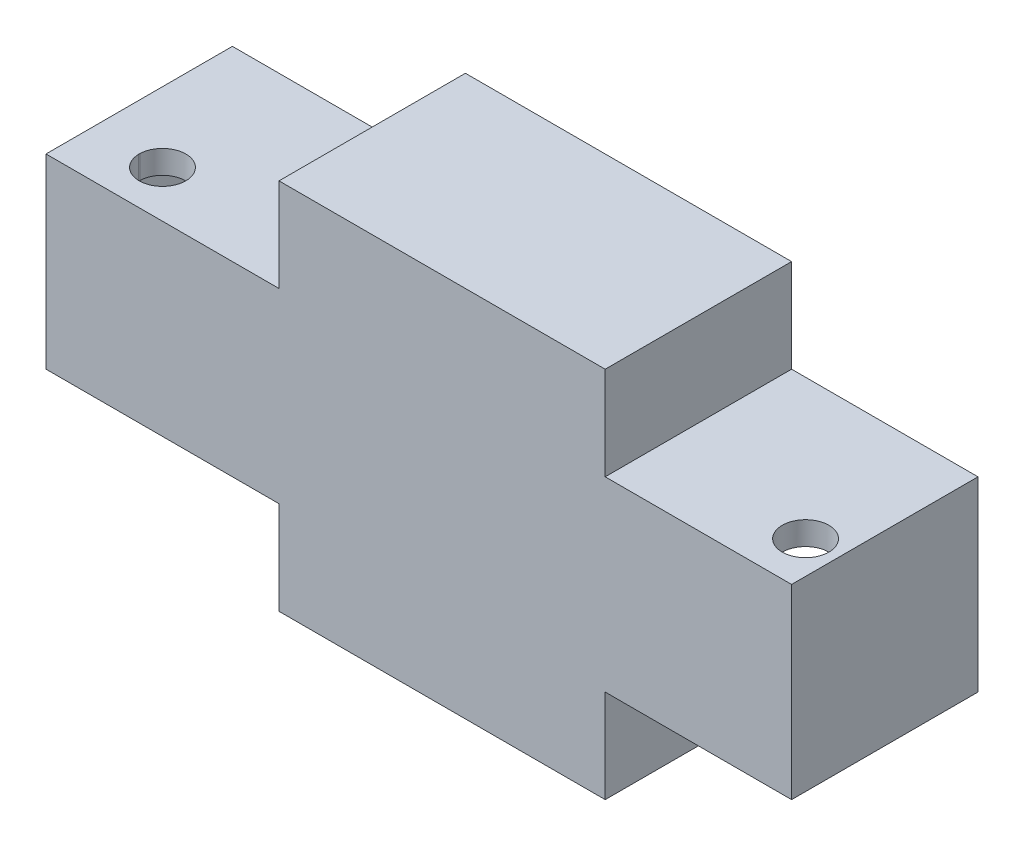
ISO-10303-21;
HEADER;
FILE_DESCRIPTION(('STEP AP214'),'2;1');
FILE_NAME('part.step','',(''),(''),'','','');
FILE_SCHEMA(('AUTOMOTIVE_DESIGN { 1 0 10303 214 1 1 1 1 }'));
ENDSEC;
DATA;
#1=APPLICATION_CONTEXT('core data for automotive mechanical design processes');
#2=APPLICATION_PROTOCOL_DEFINITION('international standard','automotive_design',2000,#1);
#3=PRODUCT_CONTEXT('',#1,'mechanical');
#4=PRODUCT('Part','Part','',(#3));
#5=PRODUCT_RELATED_PRODUCT_CATEGORY('part','',(#4));
#6=PRODUCT_DEFINITION_FORMATION('','',#4);
#7=PRODUCT_DEFINITION_CONTEXT('part definition',#1,'design');
#8=PRODUCT_DEFINITION('design','',#6,#7);
#9=PRODUCT_DEFINITION_SHAPE('','',#8);
#10=(LENGTH_UNIT() NAMED_UNIT(*) SI_UNIT(.MILLI.,.METRE.));
#11=(NAMED_UNIT(*) PLANE_ANGLE_UNIT() SI_UNIT($,.RADIAN.));
#12=(NAMED_UNIT(*) SI_UNIT($,.STERADIAN.) SOLID_ANGLE_UNIT());
#13=UNCERTAINTY_MEASURE_WITH_UNIT(LENGTH_MEASURE(1.E-05),#10,'distance_accuracy_value','');
#14=(GEOMETRIC_REPRESENTATION_CONTEXT(3) GLOBAL_UNCERTAINTY_ASSIGNED_CONTEXT((#13)) GLOBAL_UNIT_ASSIGNED_CONTEXT((#10,
#11,#12)) REPRESENTATION_CONTEXT('',''));
#15=CARTESIAN_POINT('',(0.,0.,0.));
#16=DIRECTION('',(0.,0.,1.));
#17=DIRECTION('',(1.,0.,0.));
#18=AXIS2_PLACEMENT_3D('',#15,#16,#17);
#19=CARTESIAN_POINT('',(0.,38.0846803377563,73.66));
#20=DIRECTION('',(0.,1.,0.));
#21=DIRECTION('',(0.,0.,1.));
#22=AXIS2_PLACEMENT_3D('',#19,#20,#21);
#23=PLANE('',#22);
#24=DIRECTION('',(1.,0.,0.));
#25=VECTOR('',#24,1.);
#26=CARTESIAN_POINT('',(60.1909529553679,38.0846803377563,22.86));
#27=LINE('',#26,#25);
#28=CARTESIAN_POINT('',(60.1909529553679,38.0846803377563,22.86));
#29=VERTEX_POINT('',#28);
#30=CARTESIAN_POINT('',(110.990952955368,38.0846803377563,22.86));
#31=VERTEX_POINT('',#30);
#32=EDGE_CURVE('E418',#29,#31,#27,.T.);
#33=ORIENTED_EDGE('',*,*,#32,.F.);
#34=DIRECTION('',(0.,0.,-1.));
#35=VECTOR('',#34,1.);
#36=CARTESIAN_POINT('',(60.1909529553679,38.0846803377563,73.66));
#37=LINE('',#36,#35);
#38=CARTESIAN_POINT('',(60.1909529553679,38.0846803377563,73.66));
#39=VERTEX_POINT('',#38);
#40=EDGE_CURVE('E549',#39,#29,#37,.T.);
#41=ORIENTED_EDGE('',*,*,#40,.F.);
#42=DIRECTION('',(1.,0.,0.));
#43=VECTOR('',#42,1.);
#44=CARTESIAN_POINT('',(0.,38.0846803377563,73.66));
#45=LINE('',#44,#43);
#46=CARTESIAN_POINT('',(110.990952955368,38.0846803377563,73.66));
#47=VERTEX_POINT('',#46);
#48=EDGE_CURVE('E467',#39,#47,#45,.T.);
#49=ORIENTED_EDGE('',*,*,#48,.T.);
#50=DIRECTION('',(0.,0.,-1.));
#51=VECTOR('',#50,1.);
#52=CARTESIAN_POINT('',(110.990952955368,38.0846803377563,73.66));
#53=LINE('',#52,#51);
#54=EDGE_CURVE('E505',#47,#31,#53,.T.);
#55=ORIENTED_EDGE('',*,*,#54,.T.);
#56=EDGE_LOOP('',(#33,#41,#49,#55));
#57=FACE_BOUND('',#56,.T.);
#58=CARTESIAN_POINT('',(102.100952955368,38.0846803377563,60.96));
#59=DIRECTION('',(0.,1.,0.));
#60=DIRECTION('',(0.,0.,1.));
#61=AXIS2_PLACEMENT_3D('',#58,#59,#60);
#62=CIRCLE('',#61,6.35);
#63=CARTESIAN_POINT('',(102.100952955368,38.0846803377563,67.31));
#64=VERTEX_POINT('',#63);
#65=EDGE_CURVE('E455',#64,#64,#62,.T.);
#66=ORIENTED_EDGE('',*,*,#65,.F.);
#67=EDGE_LOOP('',(#66));
#68=FACE_BOUND('',#67,.T.);
#69=ADVANCED_FACE('F43',(#57,#68),#23,.T.);
#70=CARTESIAN_POINT('',(60.1909529553679,0.,73.66));
#71=DIRECTION('',(-1.,0.,0.));
#72=DIRECTION('',(0.,0.,1.));
#73=AXIS2_PLACEMENT_3D('',#70,#71,#72);
#74=PLANE('',#73);
#75=ORIENTED_EDGE('',*,*,#40,.T.);
#76=DIRECTION('',(0.,1.,0.));
#77=VECTOR('',#76,1.);
#78=CARTESIAN_POINT('',(60.1909529553679,38.0846803377563,22.86));
#79=LINE('',#78,#77);
#80=CARTESIAN_POINT('',(60.1909529553679,63.4846803377563,22.86));
#81=VERTEX_POINT('',#80);
#82=EDGE_CURVE('E421',#29,#81,#79,.T.);
#83=ORIENTED_EDGE('',*,*,#82,.T.);
#84=DIRECTION('',(0.,0.,-1.));
#85=VECTOR('',#84,1.);
#86=CARTESIAN_POINT('',(60.1909529553679,63.4846803377563,73.66));
#87=LINE('',#86,#85);
#88=CARTESIAN_POINT('',(60.1909529553679,63.4846803377563,73.66));
#89=VERTEX_POINT('',#88);
#90=EDGE_CURVE('E545',#89,#81,#87,.T.);
#91=ORIENTED_EDGE('',*,*,#90,.F.);
#92=DIRECTION('',(0.,1.,0.));
#93=VECTOR('',#92,1.);
#94=CARTESIAN_POINT('',(60.1909529553679,0.,73.66));
#95=LINE('',#94,#93);
#96=EDGE_CURVE('E471',#39,#89,#95,.T.);
#97=ORIENTED_EDGE('',*,*,#96,.F.);
#98=EDGE_LOOP('',(#75,#83,#91,#97));
#99=FACE_BOUND('',#98,.T.);
#100=ADVANCED_FACE('F607',(#99),#74,.F.);
#101=CARTESIAN_POINT('',(0.,63.4846803377563,73.66));
#102=DIRECTION('',(0.,1.,0.));
#103=DIRECTION('',(-1.,0.,0.));
#104=AXIS2_PLACEMENT_3D('',#101,#102,#103);
#105=PLANE('',#104);
#106=DIRECTION('',(1.,0.,0.));
#107=VECTOR('',#106,1.);
#108=CARTESIAN_POINT('',(-28.7090470446321,63.4846803377563,22.86));
#109=LINE('',#108,#107);
#110=CARTESIAN_POINT('',(-28.7090470446321,63.4846803377563,22.86));
#111=VERTEX_POINT('',#110);
#112=EDGE_CURVE('E425',#111,#81,#109,.T.);
#113=ORIENTED_EDGE('',*,*,#112,.F.);
#114=DIRECTION('',(0.,0.,-1.));
#115=VECTOR('',#114,1.);
#116=CARTESIAN_POINT('',(-28.7090470446321,63.4846803377563,73.66));
#117=LINE('',#116,#115);
#118=CARTESIAN_POINT('',(-28.7090470446321,63.4846803377563,73.66));
#119=VERTEX_POINT('',#118);
#120=EDGE_CURVE('E541',#119,#111,#117,.T.);
#121=ORIENTED_EDGE('',*,*,#120,.F.);
#122=DIRECTION('',(1.,0.,0.));
#123=VECTOR('',#122,1.);
#124=CARTESIAN_POINT('',(0.,63.4846803377563,73.66));
#125=LINE('',#124,#123);
#126=EDGE_CURVE('E474',#119,#89,#125,.T.);
#127=ORIENTED_EDGE('',*,*,#126,.T.);
#128=ORIENTED_EDGE('',*,*,#90,.T.);
#129=EDGE_LOOP('',(#113,#121,#127,#128));
#130=FACE_BOUND('',#129,.T.);
#131=ADVANCED_FACE('F610',(#130),#105,.T.);
#132=CARTESIAN_POINT('',(-28.7090470446321,0.,73.66));
#133=DIRECTION('',(-1.,0.,0.));
#134=DIRECTION('',(0.,0.,1.));
#135=AXIS2_PLACEMENT_3D('',#132,#133,#134);
#136=PLANE('',#135);
#137=DIRECTION('',(0.,1.,0.));
#138=VECTOR('',#137,1.);
#139=CARTESIAN_POINT('',(-28.7090470446321,38.0846803377563,22.86));
#140=LINE('',#139,#138);
#141=CARTESIAN_POINT('',(-28.7090470446321,38.0846803377563,22.86));
#142=VERTEX_POINT('',#141);
#143=EDGE_CURVE('E428',#142,#111,#140,.T.);
#144=ORIENTED_EDGE('',*,*,#143,.F.);
#145=DIRECTION('',(0.,0.,-1.));
#146=VECTOR('',#145,1.);
#147=CARTESIAN_POINT('',(-28.7090470446321,38.0846803377563,73.66));
#148=LINE('',#147,#146);
#149=CARTESIAN_POINT('',(-28.7090470446321,38.0846803377563,73.66));
#150=VERTEX_POINT('',#149);
#151=EDGE_CURVE('E537',#150,#142,#148,.T.);
#152=ORIENTED_EDGE('',*,*,#151,.F.);
#153=DIRECTION('',(0.,1.,0.));
#154=VECTOR('',#153,1.);
#155=CARTESIAN_POINT('',(-28.7090470446321,0.,73.66));
#156=LINE('',#155,#154);
#157=EDGE_CURVE('E479',#150,#119,#156,.T.);
#158=ORIENTED_EDGE('',*,*,#157,.T.);
#159=ORIENTED_EDGE('',*,*,#120,.T.);
#160=EDGE_LOOP('',(#144,#152,#158,#159));
#161=FACE_BOUND('',#160,.T.);
#162=ADVANCED_FACE('F615',(#161),#136,.T.);
#163=CARTESIAN_POINT('',(0.,38.0846803377563,73.66));
#164=DIRECTION('',(0.,1.,0.));
#165=DIRECTION('',(0.,0.,1.));
#166=AXIS2_PLACEMENT_3D('',#163,#164,#165);
#167=PLANE('',#166);
#168=DIRECTION('',(1.,0.,0.));
#169=VECTOR('',#168,1.);
#170=CARTESIAN_POINT('',(-92.2090470446321,38.0846803377563,22.86));
#171=LINE('',#170,#169);
#172=CARTESIAN_POINT('',(-92.2090470446321,38.0846803377563,22.86));
#173=VERTEX_POINT('',#172);
#174=EDGE_CURVE('E431',#173,#142,#171,.T.);
#175=ORIENTED_EDGE('',*,*,#174,.F.);
#176=DIRECTION('',(0.,0.,-1.));
#177=VECTOR('',#176,1.);
#178=CARTESIAN_POINT('',(-92.2090470446321,38.0846803377563,73.66));
#179=LINE('',#178,#177);
#180=CARTESIAN_POINT('',(-92.2090470446321,38.0846803377563,73.66));
#181=VERTEX_POINT('',#180);
#182=EDGE_CURVE('E533',#181,#173,#179,.T.);
#183=ORIENTED_EDGE('',*,*,#182,.F.);
#184=DIRECTION('',(1.,0.,0.));
#185=VECTOR('',#184,1.);
#186=CARTESIAN_POINT('',(0.,38.0846803377563,73.66));
#187=LINE('',#186,#185);
#188=EDGE_CURVE('E483',#181,#150,#187,.T.);
#189=ORIENTED_EDGE('',*,*,#188,.T.);
#190=ORIENTED_EDGE('',*,*,#151,.T.);
#191=EDGE_LOOP('',(#175,#183,#189,#190));
#192=FACE_BOUND('',#191,.T.);
#193=CARTESIAN_POINT('',(-73.1590470446321,38.0846803377563,60.96));
#194=DIRECTION('',(0.,1.,0.));
#195=DIRECTION('',(0.,0.,1.));
#196=AXIS2_PLACEMENT_3D('',#193,#194,#195);
#197=CIRCLE('',#196,6.35);
#198=CARTESIAN_POINT('',(-79.5052440599914,38.0846803377563,61.1797349363306));
#199=VERTEX_POINT('',#198);
#200=CARTESIAN_POINT('',(-79.5052440599914,38.0846803377563,60.7402650636694));
#201=VERTEX_POINT('',#200);
#202=EDGE_CURVE('E463',#199,#201,#197,.T.);
#203=ORIENTED_EDGE('',*,*,#202,.F.);
#204=DIRECTION('',(0.,0.,-1.));
#205=VECTOR('',#204,1.);
#206=CARTESIAN_POINT('',(-79.5052440599914,38.0846803377563,73.66));
#207=LINE('',#206,#205);
#208=EDGE_CURVE('E459',#199,#201,#207,.T.);
#209=ORIENTED_EDGE('',*,*,#208,.T.);
#210=EDGE_LOOP('',(#203,#209));
#211=FACE_BOUND('',#210,.T.);
#212=ADVANCED_FACE('F575',(#192,#211),#167,.T.);
#213=CARTESIAN_POINT('',(-92.2090470446321,0.,73.66));
#214=DIRECTION('',(1.,0.,0.));
#215=DIRECTION('',(0.,0.,-1.));
#216=AXIS2_PLACEMENT_3D('',#213,#214,#215);
#217=PLANE('',#216);
#218=ORIENTED_EDGE('',*,*,#182,.T.);
#219=DIRECTION('',(0.,-1.,0.));
#220=VECTOR('',#219,1.);
#221=CARTESIAN_POINT('',(-92.2090470446321,38.0846803377563,22.86));
#222=LINE('',#221,#220);
#223=CARTESIAN_POINT('',(-92.2090470446321,-12.7153196622437,22.86));
#224=VERTEX_POINT('',#223);
#225=EDGE_CURVE('E434',#173,#224,#222,.T.);
#226=ORIENTED_EDGE('',*,*,#225,.T.);
#227=DIRECTION('',(0.,0.,-1.));
#228=VECTOR('',#227,1.);
#229=CARTESIAN_POINT('',(-92.2090470446321,-12.7153196622437,73.66));
#230=LINE('',#229,#228);
#231=CARTESIAN_POINT('',(-92.2090470446321,-12.7153196622437,73.66));
#232=VERTEX_POINT('',#231);
#233=EDGE_CURVE('E529',#232,#224,#230,.T.);
#234=ORIENTED_EDGE('',*,*,#233,.F.);
#235=DIRECTION('',(0.,-1.,0.));
#236=VECTOR('',#235,1.);
#237=CARTESIAN_POINT('',(-92.2090470446321,0.,73.66));
#238=LINE('',#237,#236);
#239=EDGE_CURVE('E488',#181,#232,#238,.T.);
#240=ORIENTED_EDGE('',*,*,#239,.F.);
#241=EDGE_LOOP('',(#218,#226,#234,#240));
#242=FACE_BOUND('',#241,.T.);
#243=ADVANCED_FACE('F623',(#242),#217,.F.);
#244=CARTESIAN_POINT('',(0.,-12.7153196622437,73.66));
#245=DIRECTION('',(0.,1.,0.));
#246=DIRECTION('',(-1.,0.,0.));
#247=AXIS2_PLACEMENT_3D('',#244,#245,#246);
#248=PLANE('',#247);
#249=DIRECTION('',(0.,0.,-1.));
#250=VECTOR('',#249,1.);
#251=CARTESIAN_POINT('',(-79.5052440599914,-12.7153196622437,73.66));
#252=LINE('',#251,#250);
#253=CARTESIAN_POINT('',(-79.5052440599914,-12.7153196622437,61.1797349363306));
#254=VERTEX_POINT('',#253);
#255=CARTESIAN_POINT('',(-79.5052440599914,-12.7153196622437,60.7402650636694));
#256=VERTEX_POINT('',#255);
#257=EDGE_CURVE('E553',#254,#256,#252,.T.);
#258=ORIENTED_EDGE('',*,*,#257,.F.);
#259=CARTESIAN_POINT('',(-73.1590470446321,-12.7153196622437,60.96));
#260=DIRECTION('',(0.,1.,0.));
#261=DIRECTION('',(-1.,0.,0.));
#262=AXIS2_PLACEMENT_3D('',#259,#260,#261);
#263=CIRCLE('',#262,6.35);
#264=EDGE_CURVE('E51',#254,#256,#263,.T.);
#265=ORIENTED_EDGE('',*,*,#264,.T.);
#266=EDGE_LOOP('',(#258,#265));
#267=FACE_BOUND('',#266,.T.);
#268=ORIENTED_EDGE('',*,*,#233,.T.);
#269=DIRECTION('',(1.,0.,0.));
#270=VECTOR('',#269,1.);
#271=CARTESIAN_POINT('',(-92.2090470446321,-12.7153196622437,22.86));
#272=LINE('',#271,#270);
#273=CARTESIAN_POINT('',(-28.7090470446321,-12.7153196622437,22.86));
#274=VERTEX_POINT('',#273);
#275=EDGE_CURVE('E438',#224,#274,#272,.T.);
#276=ORIENTED_EDGE('',*,*,#275,.T.);
#277=DIRECTION('',(0.,0.,-1.));
#278=VECTOR('',#277,1.);
#279=CARTESIAN_POINT('',(-28.7090470446321,-12.7153196622437,73.66));
#280=LINE('',#279,#278);
#281=CARTESIAN_POINT('',(-28.7090470446321,-12.7153196622437,73.66));
#282=VERTEX_POINT('',#281);
#283=EDGE_CURVE('E525',#282,#274,#280,.T.);
#284=ORIENTED_EDGE('',*,*,#283,.F.);
#285=DIRECTION('',(1.,0.,0.));
#286=VECTOR('',#285,1.);
#287=CARTESIAN_POINT('',(0.,-12.7153196622437,73.66));
#288=LINE('',#287,#286);
#289=EDGE_CURVE('E491',#232,#282,#288,.T.);
#290=ORIENTED_EDGE('',*,*,#289,.F.);
#291=EDGE_LOOP('',(#268,#276,#284,#290));
#292=FACE_BOUND('',#291,.T.);
#293=ADVANCED_FACE('F563',(#267,#292),#248,.F.);
#294=DIRECTION('',(0.,1.,0.));
#295=VECTOR('',#294,1.);
#296=CARTESIAN_POINT('',(-28.7090470446321,-38.1153196622437,22.86));
#297=LINE('',#296,#295);
#298=CARTESIAN_POINT('',(-28.7090470446321,-38.1153196622437,22.86));
#299=VERTEX_POINT('',#298);
#300=EDGE_CURVE('E442',#299,#274,#297,.T.);
#301=ORIENTED_EDGE('',*,*,#300,.F.);
#302=DIRECTION('',(0.,0.,-1.));
#303=VECTOR('',#302,1.);
#304=CARTESIAN_POINT('',(-28.7090470446321,-38.1153196622437,73.66));
#305=LINE('',#304,#303);
#306=CARTESIAN_POINT('',(-28.7090470446321,-38.1153196622437,73.66));
#307=VERTEX_POINT('',#306);
#308=EDGE_CURVE('E521',#307,#299,#305,.T.);
#309=ORIENTED_EDGE('',*,*,#308,.F.);
#310=EDGE_CURVE('E484',#307,#282,#156,.T.);
#311=ORIENTED_EDGE('',*,*,#310,.T.);
#312=ORIENTED_EDGE('',*,*,#283,.T.);
#313=EDGE_LOOP('',(#301,#309,#311,#312));
#314=FACE_BOUND('',#313,.T.);
#315=ADVANCED_FACE('F626',(#314),#136,.T.);
#316=CARTESIAN_POINT('',(0.,-38.1153196622437,73.66));
#317=DIRECTION('',(0.,1.,0.));
#318=DIRECTION('',(0.,0.,1.));
#319=AXIS2_PLACEMENT_3D('',#316,#317,#318);
#320=PLANE('',#319);
#321=ORIENTED_EDGE('',*,*,#308,.T.);
#322=DIRECTION('',(1.,0.,0.));
#323=VECTOR('',#322,1.);
#324=CARTESIAN_POINT('',(-28.7090470446321,-38.1153196622437,22.86));
#325=LINE('',#324,#323);
#326=CARTESIAN_POINT('',(60.1909529553679,-38.1153196622437,22.86));
#327=VERTEX_POINT('',#326);
#328=EDGE_CURVE('E404',#299,#327,#325,.T.);
#329=ORIENTED_EDGE('',*,*,#328,.T.);
#330=DIRECTION('',(0.,0.,-1.));
#331=VECTOR('',#330,1.);
#332=CARTESIAN_POINT('',(60.1909529553679,-38.1153196622437,73.66));
#333=LINE('',#332,#331);
#334=CARTESIAN_POINT('',(60.1909529553679,-38.1153196622437,73.66));
#335=VERTEX_POINT('',#334);
#336=EDGE_CURVE('E517',#335,#327,#333,.T.);
#337=ORIENTED_EDGE('',*,*,#336,.F.);
#338=DIRECTION('',(1.,0.,0.));
#339=VECTOR('',#338,1.);
#340=CARTESIAN_POINT('',(0.,-38.1153196622437,73.66));
#341=LINE('',#340,#339);
#342=EDGE_CURVE('E494',#307,#335,#341,.T.);
#343=ORIENTED_EDGE('',*,*,#342,.F.);
#344=EDGE_LOOP('',(#321,#329,#337,#343));
#345=FACE_BOUND('',#344,.T.);
#346=ADVANCED_FACE('F628',(#345),#320,.F.);
#347=ORIENTED_EDGE('',*,*,#336,.T.);
#348=DIRECTION('',(0.,1.,0.));
#349=VECTOR('',#348,1.);
#350=CARTESIAN_POINT('',(60.1909529553679,-38.1153196622437,22.86));
#351=LINE('',#350,#349);
#352=CARTESIAN_POINT('',(60.1909529553679,-12.7153196622437,22.86));
#353=VERTEX_POINT('',#352);
#354=EDGE_CURVE('E408',#327,#353,#351,.T.);
#355=ORIENTED_EDGE('',*,*,#354,.T.);
#356=DIRECTION('',(0.,0.,-1.));
#357=VECTOR('',#356,1.);
#358=CARTESIAN_POINT('',(60.1909529553679,-12.7153196622437,73.66));
#359=LINE('',#358,#357);
#360=CARTESIAN_POINT('',(60.1909529553679,-12.7153196622437,73.66));
#361=VERTEX_POINT('',#360);
#362=EDGE_CURVE('E513',#361,#353,#359,.T.);
#363=ORIENTED_EDGE('',*,*,#362,.F.);
#364=EDGE_CURVE('E475',#335,#361,#95,.T.);
#365=ORIENTED_EDGE('',*,*,#364,.F.);
#366=EDGE_LOOP('',(#347,#355,#363,#365));
#367=FACE_BOUND('',#366,.T.);
#368=ADVANCED_FACE('F592',(#367),#74,.F.);
#369=CARTESIAN_POINT('',(0.,-12.7153196622437,73.66));
#370=DIRECTION('',(0.,-1.,0.));
#371=DIRECTION('',(1.,0.,0.));
#372=AXIS2_PLACEMENT_3D('',#369,#370,#371);
#373=PLANE('',#372);
#374=DIRECTION('',(-1.,0.,0.));
#375=VECTOR('',#374,1.);
#376=CARTESIAN_POINT('',(110.990952955368,-12.7153196622437,22.86));
#377=LINE('',#376,#375);
#378=CARTESIAN_POINT('',(110.990952955368,-12.7153196622437,22.86));
#379=VERTEX_POINT('',#378);
#380=EDGE_CURVE('E412',#379,#353,#377,.T.);
#381=ORIENTED_EDGE('',*,*,#380,.F.);
#382=DIRECTION('',(0.,0.,-1.));
#383=VECTOR('',#382,1.);
#384=CARTESIAN_POINT('',(110.990952955368,-12.7153196622437,73.66));
#385=LINE('',#384,#383);
#386=CARTESIAN_POINT('',(110.990952955368,-12.7153196622437,73.66));
#387=VERTEX_POINT('',#386);
#388=EDGE_CURVE('E509',#387,#379,#385,.T.);
#389=ORIENTED_EDGE('',*,*,#388,.F.);
#390=DIRECTION('',(-1.,0.,0.));
#391=VECTOR('',#390,1.);
#392=CARTESIAN_POINT('',(0.,-12.7153196622437,73.66));
#393=LINE('',#392,#391);
#394=EDGE_CURVE('E497',#387,#361,#393,.T.);
#395=ORIENTED_EDGE('',*,*,#394,.T.);
#396=ORIENTED_EDGE('',*,*,#362,.T.);
#397=EDGE_LOOP('',(#381,#389,#395,#396));
#398=FACE_BOUND('',#397,.T.);
#399=CARTESIAN_POINT('',(102.100952955368,-12.7153196622437,60.96));
#400=DIRECTION('',(0.,-1.,0.));
#401=DIRECTION('',(1.,0.,0.));
#402=AXIS2_PLACEMENT_3D('',#399,#400,#401);
#403=CIRCLE('',#402,6.35);
#404=CARTESIAN_POINT('',(108.450952955368,-12.7153196622437,60.96));
#405=VERTEX_POINT('',#404);
#406=EDGE_CURVE('E450',#405,#405,#403,.T.);
#407=ORIENTED_EDGE('',*,*,#406,.F.);
#408=EDGE_LOOP('',(#407));
#409=FACE_BOUND('',#408,.T.);
#410=ADVANCED_FACE('F595',(#398,#409),#373,.T.);
#411=CARTESIAN_POINT('',(110.990952955368,0.,73.66));
#412=DIRECTION('',(1.,0.,0.));
#413=DIRECTION('',(0.,0.,-1.));
#414=AXIS2_PLACEMENT_3D('',#411,#412,#413);
#415=PLANE('',#414);
#416=DIRECTION('',(0.,-1.,0.));
#417=VECTOR('',#416,1.);
#418=CARTESIAN_POINT('',(110.990952955368,38.0846803377563,22.86));
#419=LINE('',#418,#417);
#420=EDGE_CURVE('E415',#31,#379,#419,.T.);
#421=ORIENTED_EDGE('',*,*,#420,.F.);
#422=ORIENTED_EDGE('',*,*,#54,.F.);
#423=DIRECTION('',(0.,-1.,0.));
#424=VECTOR('',#423,1.);
#425=CARTESIAN_POINT('',(110.990952955368,0.,73.66));
#426=LINE('',#425,#424);
#427=EDGE_CURVE('E501',#47,#387,#426,.T.);
#428=ORIENTED_EDGE('',*,*,#427,.T.);
#429=ORIENTED_EDGE('',*,*,#388,.T.);
#430=EDGE_LOOP('',(#421,#422,#428,#429));
#431=FACE_BOUND('',#430,.T.);
#432=ADVANCED_FACE('F599',(#431),#415,.T.);
#433=CARTESIAN_POINT('',(0.,0.,73.66));
#434=DIRECTION('',(0.,0.,1.));
#435=DIRECTION('',(1.,0.,0.));
#436=AXIS2_PLACEMENT_3D('',#433,#434,#435);
#437=PLANE('',#436);
#438=ORIENTED_EDGE('',*,*,#48,.F.);
#439=ORIENTED_EDGE('',*,*,#96,.T.);
#440=ORIENTED_EDGE('',*,*,#126,.F.);
#441=ORIENTED_EDGE('',*,*,#157,.F.);
#442=ORIENTED_EDGE('',*,*,#188,.F.);
#443=ORIENTED_EDGE('',*,*,#239,.T.);
#444=ORIENTED_EDGE('',*,*,#289,.T.);
#445=ORIENTED_EDGE('',*,*,#310,.F.);
#446=ORIENTED_EDGE('',*,*,#342,.T.);
#447=ORIENTED_EDGE('',*,*,#364,.T.);
#448=ORIENTED_EDGE('',*,*,#394,.F.);
#449=ORIENTED_EDGE('',*,*,#427,.F.);
#450=EDGE_LOOP('',(#438,#439,#440,#441,#442,#443,#444,#445,#446,#447,#448,#449));
#451=FACE_BOUND('',#450,.T.);
#452=ADVANCED_FACE('F586',(#451),#437,.T.);
#453=CARTESIAN_POINT('',(102.100952955368,-38.1153196622437,60.96));
#454=DIRECTION('',(0.,1.,0.));
#455=DIRECTION('',(0.,0.,1.));
#456=AXIS2_PLACEMENT_3D('',#453,#454,#455);
#457=CYLINDRICAL_SURFACE('',#456,6.35);
#458=DIRECTION('',(0.,1.,0.));
#459=VECTOR('',#458,1.);
#460=CARTESIAN_POINT('',(104.640952955368,-38.1153196622437,55.1401288674061));
#461=LINE('',#460,#459);
#462=CARTESIAN_POINT('',(104.640952955368,-6.36531966224367,55.1401288674061));
#463=VERTEX_POINT('',#462);
#464=CARTESIAN_POINT('',(104.640952955368,31.7346803377563,55.1401288674061));
#465=VERTEX_POINT('',#464);
#466=EDGE_CURVE('E384',#463,#465,#461,.T.);
#467=ORIENTED_EDGE('',*,*,#466,.F.);
#468=CARTESIAN_POINT('',(102.100952955368,-6.36531966224367,60.96));
#469=DIRECTION('',(0.,-1.,0.));
#470=DIRECTION('',(1.,0.,0.));
#471=AXIS2_PLACEMENT_3D('',#468,#469,#470);
#472=CIRCLE('',#471,6.35);
#473=CARTESIAN_POINT('',(95.7509529553679,-6.36531966224367,60.96));
#474=VERTEX_POINT('',#473);
#475=EDGE_CURVE('E387',#463,#474,#472,.F.);
#476=ORIENTED_EDGE('',*,*,#475,.T.);
#477=DIRECTION('',(0.,1.,0.));
#478=VECTOR('',#477,1.);
#479=CARTESIAN_POINT('',(95.7509529553679,-38.1153196622437,60.96));
#480=LINE('',#479,#478);
#481=CARTESIAN_POINT('',(95.7509529553679,31.7346803377563,60.96));
#482=VERTEX_POINT('',#481);
#483=EDGE_CURVE('E401',#482,#474,#480,.F.);
#484=ORIENTED_EDGE('',*,*,#483,.F.);
#485=CARTESIAN_POINT('',(102.100952955368,31.7346803377563,60.96));
#486=DIRECTION('',(0.,1.,0.));
#487=DIRECTION('',(0.,0.,1.));
#488=AXIS2_PLACEMENT_3D('',#485,#486,#487);
#489=CIRCLE('',#488,6.35);
#490=EDGE_CURVE('E380',#482,#465,#489,.F.);
#491=ORIENTED_EDGE('',*,*,#490,.T.);
#492=EDGE_LOOP('',(#467,#476,#484,#491));
#493=FACE_BOUND('',#492,.T.);
#494=ORIENTED_EDGE('',*,*,#65,.T.);
#495=EDGE_LOOP('',(#494));
#496=FACE_BOUND('',#495,.T.);
#497=ORIENTED_EDGE('',*,*,#406,.T.);
#498=EDGE_LOOP('',(#497));
#499=FACE_BOUND('',#498,.T.);
#500=ADVANCED_FACE('F694',(#493,#496,#499),#457,.F.);
#501=CARTESIAN_POINT('',(-73.1590470446321,-38.1153196622437,60.96));
#502=DIRECTION('',(0.,1.,0.));
#503=DIRECTION('',(0.,0.,1.));
#504=AXIS2_PLACEMENT_3D('',#501,#502,#503);
#505=CYLINDRICAL_SURFACE('',#504,6.35);
#506=DIRECTION('',(0.,1.,0.));
#507=VECTOR('',#506,1.);
#508=CARTESIAN_POINT('',(-66.8090470446321,-38.1153196622437,60.96));
#509=LINE('',#508,#507);
#510=CARTESIAN_POINT('',(-66.8090470446321,-6.36531966224367,60.96));
#511=VERTEX_POINT('',#510);
#512=CARTESIAN_POINT('',(-66.8090470446321,31.7346803377563,60.96));
#513=VERTEX_POINT('',#512);
#514=EDGE_CURVE('E398',#511,#513,#509,.T.);
#515=ORIENTED_EDGE('',*,*,#514,.F.);
#516=CARTESIAN_POINT('',(-73.1590470446321,-6.36531966224367,60.96));
#517=DIRECTION('',(0.,-1.,0.));
#518=DIRECTION('',(1.,0.,0.));
#519=AXIS2_PLACEMENT_3D('',#516,#517,#518);
#520=CIRCLE('',#519,6.35);
#521=CARTESIAN_POINT('',(-79.5052440599914,-6.36531966224367,60.7402650636694));
#522=VERTEX_POINT('',#521);
#523=EDGE_CURVE('E394',#511,#522,#520,.F.);
#524=ORIENTED_EDGE('',*,*,#523,.T.);
#525=DIRECTION('',(0.,1.,0.));
#526=VECTOR('',#525,1.);
#527=CARTESIAN_POINT('',(-79.5052440599914,-38.1153196622437,60.7402650636694));
#528=LINE('',#527,#526);
#529=EDGE_CURVE('E451',#256,#522,#528,.T.);
#530=ORIENTED_EDGE('',*,*,#529,.F.);
#531=ORIENTED_EDGE('',*,*,#264,.F.);
#532=DIRECTION('',(0.,1.,0.));
#533=VECTOR('',#532,1.);
#534=CARTESIAN_POINT('',(-79.5052440599914,-38.1153196622437,61.1797349363306));
#535=LINE('',#534,#533);
#536=EDGE_CURVE('E446',#254,#199,#535,.T.);
#537=ORIENTED_EDGE('',*,*,#536,.T.);
#538=ORIENTED_EDGE('',*,*,#202,.T.);
#539=CARTESIAN_POINT('',(-79.5052440599914,31.7346803377563,60.7402650636694));
#540=VERTEX_POINT('',#539);
#541=EDGE_CURVE('E445',#540,#201,#528,.T.);
#542=ORIENTED_EDGE('',*,*,#541,.F.);
#543=CARTESIAN_POINT('',(-73.1590470446321,31.7346803377563,60.96));
#544=DIRECTION('',(0.,1.,0.));
#545=DIRECTION('',(-1.,0.,0.));
#546=AXIS2_PLACEMENT_3D('',#543,#544,#545);
#547=CIRCLE('',#546,6.35);
#548=EDGE_CURVE('E376',#540,#513,#547,.F.);
#549=ORIENTED_EDGE('',*,*,#548,.T.);
#550=EDGE_LOOP('',(#515,#524,#530,#531,#537,#538,#542,#549));
#551=FACE_BOUND('',#550,.T.);
#552=ADVANCED_FACE('F568',(#551),#505,.F.);
#553=CARTESIAN_POINT('',(-79.5052440599914,-38.1153196622437,0.));
#554=DIRECTION('',(1.,0.,0.));
#555=DIRECTION('',(0.,0.,-1.));
#556=AXIS2_PLACEMENT_3D('',#553,#554,#555);
#557=PLANE('',#556);
#558=DIRECTION('',(0.,0.,-1.));
#559=VECTOR('',#558,1.);
#560=CARTESIAN_POINT('',(-79.5052440599914,-6.36531966224367,0.));
#561=LINE('',#560,#559);
#562=CARTESIAN_POINT('',(-79.5052440599914,-6.36531966224367,60.96));
#563=VERTEX_POINT('',#562);
#564=EDGE_CURVE('E391',#563,#522,#561,.T.);
#565=ORIENTED_EDGE('',*,*,#564,.F.);
#566=DIRECTION('',(0.,1.,0.));
#567=VECTOR('',#566,1.);
#568=CARTESIAN_POINT('',(-79.5052440599914,-38.1153196622437,60.96));
#569=LINE('',#568,#567);
#570=CARTESIAN_POINT('',(-79.5052440599914,31.7346803377563,60.96));
#571=VERTEX_POINT('',#570);
#572=EDGE_CURVE('E11',#563,#571,#569,.T.);
#573=ORIENTED_EDGE('',*,*,#572,.T.);
#574=DIRECTION('',(0.,0.,1.));
#575=VECTOR('',#574,1.);
#576=CARTESIAN_POINT('',(-79.5052440599914,31.7346803377563,0.));
#577=LINE('',#576,#575);
#578=EDGE_CURVE('E256',#540,#571,#577,.T.);
#579=ORIENTED_EDGE('',*,*,#578,.F.);
#580=ORIENTED_EDGE('',*,*,#541,.T.);
#581=ORIENTED_EDGE('',*,*,#208,.F.);
#582=ORIENTED_EDGE('',*,*,#536,.F.);
#583=ORIENTED_EDGE('',*,*,#257,.T.);
#584=ORIENTED_EDGE('',*,*,#529,.T.);
#585=EDGE_LOOP('',(#565,#573,#579,#580,#581,#582,#583,#584));
#586=FACE_BOUND('',#585,.T.);
#587=ADVANCED_FACE('F572',(#586),#557,.T.);
#588=CARTESIAN_POINT('',(0.,0.,22.86));
#589=DIRECTION('',(0.,0.,1.));
#590=DIRECTION('',(1.,0.,0.));
#591=AXIS2_PLACEMENT_3D('',#588,#589,#590);
#592=PLANE('',#591);
#593=DIRECTION('',(1.,0.,0.));
#594=VECTOR('',#593,1.);
#595=CARTESIAN_POINT('',(-85.8590470446321,31.7346803377563,22.86));
#596=LINE('',#595,#594);
#597=CARTESIAN_POINT('',(-85.8590470446321,31.7346803377563,22.86));
#598=VERTEX_POINT('',#597);
#599=CARTESIAN_POINT('',(-22.3590470446321,31.7346803377563,22.86));
#600=VERTEX_POINT('',#599);
#601=EDGE_CURVE('E304',#598,#600,#596,.T.);
#602=ORIENTED_EDGE('',*,*,#601,.F.);
#603=DIRECTION('',(0.,1.,0.));
#604=VECTOR('',#603,1.);
#605=CARTESIAN_POINT('',(-85.8590470446321,-6.36531966224367,22.86));
#606=LINE('',#605,#604);
#607=CARTESIAN_POINT('',(-85.8590470446321,-6.36531966224367,22.86));
#608=VERTEX_POINT('',#607);
#609=EDGE_CURVE('E246',#608,#598,#606,.T.);
#610=ORIENTED_EDGE('',*,*,#609,.F.);
#611=DIRECTION('',(-1.,0.,0.));
#612=VECTOR('',#611,1.);
#613=CARTESIAN_POINT('',(-22.3590470446321,-6.36531966224367,22.86));
#614=LINE('',#613,#612);
#615=CARTESIAN_POINT('',(-22.3590470446321,-6.36531966224367,22.86));
#616=VERTEX_POINT('',#615);
#617=EDGE_CURVE('E266',#616,#608,#614,.T.);
#618=ORIENTED_EDGE('',*,*,#617,.F.);
#619=DIRECTION('',(0.,-1.,0.));
#620=VECTOR('',#619,1.);
#621=CARTESIAN_POINT('',(-22.3590470446321,-6.36531966224367,22.86));
#622=LINE('',#621,#620);
#623=CARTESIAN_POINT('',(-22.3590470446321,-31.7653196622437,22.86));
#624=VERTEX_POINT('',#623);
#625=EDGE_CURVE('E271',#616,#624,#622,.T.);
#626=ORIENTED_EDGE('',*,*,#625,.T.);
#627=DIRECTION('',(1.,0.,0.));
#628=VECTOR('',#627,1.);
#629=CARTESIAN_POINT('',(-22.3590470446321,-31.7653196622437,22.86));
#630=LINE('',#629,#628);
#631=CARTESIAN_POINT('',(53.8409529553679,-31.7653196622437,22.86));
#632=VERTEX_POINT('',#631);
#633=EDGE_CURVE('E335',#624,#632,#630,.T.);
#634=ORIENTED_EDGE('',*,*,#633,.T.);
#635=DIRECTION('',(0.,1.,0.));
#636=VECTOR('',#635,1.);
#637=CARTESIAN_POINT('',(53.8409529553679,-31.7653196622437,22.86));
#638=LINE('',#637,#636);
#639=CARTESIAN_POINT('',(53.8409529553679,-6.36531966224367,22.86));
#640=VERTEX_POINT('',#639);
#641=EDGE_CURVE('E331',#632,#640,#638,.T.);
#642=ORIENTED_EDGE('',*,*,#641,.T.);
#643=DIRECTION('',(-1.,0.,0.));
#644=VECTOR('',#643,1.);
#645=CARTESIAN_POINT('',(104.640952955368,-6.36531966224367,22.86));
#646=LINE('',#645,#644);
#647=CARTESIAN_POINT('',(104.640952955368,-6.36531966224367,22.86));
#648=VERTEX_POINT('',#647);
#649=EDGE_CURVE('E327',#648,#640,#646,.T.);
#650=ORIENTED_EDGE('',*,*,#649,.F.);
#651=DIRECTION('',(0.,1.,0.));
#652=VECTOR('',#651,1.);
#653=CARTESIAN_POINT('',(104.640952955368,-6.36531966224367,22.86));
#654=LINE('',#653,#652);
#655=CARTESIAN_POINT('',(104.640952955368,31.7346803377563,22.86));
#656=VERTEX_POINT('',#655);
#657=EDGE_CURVE('E323',#648,#656,#654,.T.);
#658=ORIENTED_EDGE('',*,*,#657,.T.);
#659=DIRECTION('',(1.,0.,0.));
#660=VECTOR('',#659,1.);
#661=CARTESIAN_POINT('',(53.8409529553679,31.7346803377563,22.86));
#662=LINE('',#661,#660);
#663=CARTESIAN_POINT('',(53.8409529553679,31.7346803377563,22.86));
#664=VERTEX_POINT('',#663);
#665=EDGE_CURVE('E319',#664,#656,#662,.T.);
#666=ORIENTED_EDGE('',*,*,#665,.F.);
#667=DIRECTION('',(0.,1.,0.));
#668=VECTOR('',#667,1.);
#669=CARTESIAN_POINT('',(53.8409529553679,31.7346803377563,22.86));
#670=LINE('',#669,#668);
#671=CARTESIAN_POINT('',(53.8409529553679,57.1346803377563,22.86));
#672=VERTEX_POINT('',#671);
#673=EDGE_CURVE('E315',#664,#672,#670,.T.);
#674=ORIENTED_EDGE('',*,*,#673,.T.);
#675=DIRECTION('',(1.,0.,0.));
#676=VECTOR('',#675,1.);
#677=CARTESIAN_POINT('',(-22.3590470446321,57.1346803377563,22.86));
#678=LINE('',#677,#676);
#679=CARTESIAN_POINT('',(-22.3590470446321,57.1346803377563,22.86));
#680=VERTEX_POINT('',#679);
#681=EDGE_CURVE('E311',#680,#672,#678,.T.);
#682=ORIENTED_EDGE('',*,*,#681,.F.);
#683=DIRECTION('',(0.,-1.,0.));
#684=VECTOR('',#683,1.);
#685=CARTESIAN_POINT('',(-22.3590470446321,57.1346803377563,22.86));
#686=LINE('',#685,#684);
#687=EDGE_CURVE('E307',#680,#600,#686,.T.);
#688=ORIENTED_EDGE('',*,*,#687,.T.);
#689=EDGE_LOOP('',(#602,#610,#618,#626,#634,#642,#650,#658,#666,#674,#682,#688));
#690=FACE_BOUND('',#689,.T.);
#691=ORIENTED_EDGE('',*,*,#328,.F.);
#692=ORIENTED_EDGE('',*,*,#300,.T.);
#693=ORIENTED_EDGE('',*,*,#275,.F.);
#694=ORIENTED_EDGE('',*,*,#225,.F.);
#695=ORIENTED_EDGE('',*,*,#174,.T.);
#696=ORIENTED_EDGE('',*,*,#143,.T.);
#697=ORIENTED_EDGE('',*,*,#112,.T.);
#698=ORIENTED_EDGE('',*,*,#82,.F.);
#699=ORIENTED_EDGE('',*,*,#32,.T.);
#700=ORIENTED_EDGE('',*,*,#420,.T.);
#701=ORIENTED_EDGE('',*,*,#380,.T.);
#702=ORIENTED_EDGE('',*,*,#354,.F.);
#703=EDGE_LOOP('',(#691,#692,#693,#694,#695,#696,#697,#698,#699,#700,#701,#702));
#704=FACE_BOUND('',#703,.T.);
#705=ADVANCED_FACE('F630',(#690,#704),#592,.F.);
#706=CARTESIAN_POINT('',(0.,0.,60.96));
#707=DIRECTION('',(0.,0.,-1.));
#708=DIRECTION('',(-1.,0.,0.));
#709=AXIS2_PLACEMENT_3D('',#706,#707,#708);
#710=PLANE('',#709);
#711=ORIENTED_EDGE('',*,*,#483,.T.);
#712=DIRECTION('',(-1.,0.,0.));
#713=VECTOR('',#712,1.);
#714=CARTESIAN_POINT('',(104.640952955368,-6.36531966224367,60.96));
#715=LINE('',#714,#713);
#716=CARTESIAN_POINT('',(53.8409529553679,-6.36531966224367,60.96));
#717=VERTEX_POINT('',#716);
#718=EDGE_CURVE('E286',#474,#717,#715,.T.);
#719=ORIENTED_EDGE('',*,*,#718,.T.);
#720=DIRECTION('',(0.,1.,0.));
#721=VECTOR('',#720,1.);
#722=CARTESIAN_POINT('',(53.8409529553679,-31.7653196622437,60.96));
#723=LINE('',#722,#721);
#724=CARTESIAN_POINT('',(53.8409529553679,-31.7653196622437,60.96));
#725=VERTEX_POINT('',#724);
#726=EDGE_CURVE('E289',#725,#717,#723,.T.);
#727=ORIENTED_EDGE('',*,*,#726,.F.);
#728=DIRECTION('',(1.,0.,0.));
#729=VECTOR('',#728,1.);
#730=CARTESIAN_POINT('',(-22.3590470446321,-31.7653196622437,60.96));
#731=LINE('',#730,#729);
#732=CARTESIAN_POINT('',(-22.3590470446321,-31.7653196622437,60.96));
#733=VERTEX_POINT('',#732);
#734=EDGE_CURVE('E293',#733,#725,#731,.T.);
#735=ORIENTED_EDGE('',*,*,#734,.F.);
#736=DIRECTION('',(0.,-1.,0.));
#737=VECTOR('',#736,1.);
#738=CARTESIAN_POINT('',(-22.3590470446321,-6.36531966224367,60.96));
#739=LINE('',#738,#737);
#740=CARTESIAN_POINT('',(-22.3590470446321,-6.36531966224367,60.96));
#741=VERTEX_POINT('',#740);
#742=EDGE_CURVE('E296',#741,#733,#739,.T.);
#743=ORIENTED_EDGE('',*,*,#742,.F.);
#744=DIRECTION('',(-1.,0.,0.));
#745=VECTOR('',#744,1.);
#746=CARTESIAN_POINT('',(-22.3590470446321,-6.36531966224367,60.96));
#747=LINE('',#746,#745);
#748=EDGE_CURVE('E252',#741,#511,#747,.T.);
#749=ORIENTED_EDGE('',*,*,#748,.T.);
#750=ORIENTED_EDGE('',*,*,#514,.T.);
#751=DIRECTION('',(1.,0.,0.));
#752=VECTOR('',#751,1.);
#753=CARTESIAN_POINT('',(-85.8590470446321,31.7346803377563,60.96));
#754=LINE('',#753,#752);
#755=CARTESIAN_POINT('',(-22.3590470446321,31.7346803377563,60.96));
#756=VERTEX_POINT('',#755);
#757=EDGE_CURVE('E259',#513,#756,#754,.T.);
#758=ORIENTED_EDGE('',*,*,#757,.T.);
#759=DIRECTION('',(0.,-1.,0.));
#760=VECTOR('',#759,1.);
#761=CARTESIAN_POINT('',(-22.3590470446321,57.1346803377563,60.96));
#762=LINE('',#761,#760);
#763=CARTESIAN_POINT('',(-22.3590470446321,57.1346803377563,60.96));
#764=VERTEX_POINT('',#763);
#765=EDGE_CURVE('E258',#764,#756,#762,.T.);
#766=ORIENTED_EDGE('',*,*,#765,.F.);
#767=DIRECTION('',(1.,0.,0.));
#768=VECTOR('',#767,1.);
#769=CARTESIAN_POINT('',(-22.3590470446321,57.1346803377563,60.96));
#770=LINE('',#769,#768);
#771=CARTESIAN_POINT('',(53.8409529553679,57.1346803377563,60.96));
#772=VERTEX_POINT('',#771);
#773=EDGE_CURVE('E277',#764,#772,#770,.T.);
#774=ORIENTED_EDGE('',*,*,#773,.T.);
#775=DIRECTION('',(0.,1.,0.));
#776=VECTOR('',#775,1.);
#777=CARTESIAN_POINT('',(53.8409529553679,31.7346803377563,60.96));
#778=LINE('',#777,#776);
#779=CARTESIAN_POINT('',(53.8409529553679,31.7346803377563,60.96));
#780=VERTEX_POINT('',#779);
#781=EDGE_CURVE('E281',#780,#772,#778,.T.);
#782=ORIENTED_EDGE('',*,*,#781,.F.);
#783=DIRECTION('',(1.,0.,0.));
#784=VECTOR('',#783,1.);
#785=CARTESIAN_POINT('',(53.8409529553679,31.7346803377563,60.96));
#786=LINE('',#785,#784);
#787=EDGE_CURVE('E58',#780,#482,#786,.T.);
#788=ORIENTED_EDGE('',*,*,#787,.T.);
#789=EDGE_LOOP('',(#711,#719,#727,#735,#743,#749,#750,#758,#766,#774,#782,#788));
#790=FACE_BOUND('',#789,.T.);
#791=ADVANCED_FACE('F632',(#790),#710,.T.);
#792=CARTESIAN_POINT('',(-22.3590470446321,-6.36531966224367,60.96));
#793=DIRECTION('',(0.,-1.,0.));
#794=DIRECTION('',(1.,0.,0.));
#795=AXIS2_PLACEMENT_3D('',#792,#793,#794);
#796=PLANE('',#795);
#797=ORIENTED_EDGE('',*,*,#748,.F.);
#798=DIRECTION('',(0.,0.,-1.));
#799=VECTOR('',#798,1.);
#800=CARTESIAN_POINT('',(-22.3590470446321,-6.36531966224367,60.96));
#801=LINE('',#800,#799);
#802=EDGE_CURVE('E345',#741,#616,#801,.T.);
#803=ORIENTED_EDGE('',*,*,#802,.T.);
#804=ORIENTED_EDGE('',*,*,#617,.T.);
#805=DIRECTION('',(0.,0.,-1.));
#806=VECTOR('',#805,1.);
#807=CARTESIAN_POINT('',(-85.8590470446321,-6.36531966224367,60.96));
#808=LINE('',#807,#806);
#809=CARTESIAN_POINT('',(-85.8590470446321,-6.36531966224367,60.96));
#810=VERTEX_POINT('',#809);
#811=EDGE_CURVE('E342',#810,#608,#808,.T.);
#812=ORIENTED_EDGE('',*,*,#811,.F.);
#813=EDGE_CURVE('E263',#563,#810,#747,.T.);
#814=ORIENTED_EDGE('',*,*,#813,.F.);
#815=ORIENTED_EDGE('',*,*,#564,.T.);
#816=ORIENTED_EDGE('',*,*,#523,.F.);
#817=EDGE_LOOP('',(#797,#803,#804,#812,#814,#815,#816));
#818=FACE_BOUND('',#817,.T.);
#819=ADVANCED_FACE('F639',(#818),#796,.F.);
#820=CARTESIAN_POINT('',(104.640952955368,-6.36531966224367,60.96));
#821=DIRECTION('',(0.,-1.,0.));
#822=DIRECTION('',(1.,0.,0.));
#823=AXIS2_PLACEMENT_3D('',#820,#821,#822);
#824=PLANE('',#823);
#825=DIRECTION('',(0.,0.,-1.));
#826=VECTOR('',#825,1.);
#827=CARTESIAN_POINT('',(104.640952955368,-6.36531966224367,60.96));
#828=LINE('',#827,#826);
#829=EDGE_CURVE('E357',#463,#648,#828,.T.);
#830=ORIENTED_EDGE('',*,*,#829,.T.);
#831=ORIENTED_EDGE('',*,*,#649,.T.);
#832=DIRECTION('',(0.,0.,-1.));
#833=VECTOR('',#832,1.);
#834=CARTESIAN_POINT('',(53.8409529553679,-6.36531966224367,60.96));
#835=LINE('',#834,#833);
#836=EDGE_CURVE('E354',#717,#640,#835,.T.);
#837=ORIENTED_EDGE('',*,*,#836,.F.);
#838=ORIENTED_EDGE('',*,*,#718,.F.);
#839=ORIENTED_EDGE('',*,*,#475,.F.);
#840=EDGE_LOOP('',(#830,#831,#837,#838,#839));
#841=FACE_BOUND('',#840,.T.);
#842=ADVANCED_FACE('F737',(#841),#824,.F.);
#843=CARTESIAN_POINT('',(104.640952955368,-6.36531966224367,60.96));
#844=DIRECTION('',(-1.,0.,0.));
#845=DIRECTION('',(0.,0.,1.));
#846=AXIS2_PLACEMENT_3D('',#843,#844,#845);
#847=PLANE('',#846);
#848=ORIENTED_EDGE('',*,*,#466,.T.);
#849=DIRECTION('',(0.,0.,-1.));
#850=VECTOR('',#849,1.);
#851=CARTESIAN_POINT('',(104.640952955368,31.7346803377563,60.96));
#852=LINE('',#851,#850);
#853=EDGE_CURVE('E360',#465,#656,#852,.T.);
#854=ORIENTED_EDGE('',*,*,#853,.T.);
#855=ORIENTED_EDGE('',*,*,#657,.F.);
#856=ORIENTED_EDGE('',*,*,#829,.F.);
#857=EDGE_LOOP('',(#848,#854,#855,#856));
#858=FACE_BOUND('',#857,.T.);
#859=ADVANCED_FACE('F747',(#858),#847,.T.);
#860=CARTESIAN_POINT('',(53.8409529553679,31.7346803377563,60.96));
#861=DIRECTION('',(0.,1.,0.));
#862=DIRECTION('',(0.,0.,1.));
#863=AXIS2_PLACEMENT_3D('',#860,#861,#862);
#864=PLANE('',#863);
#865=ORIENTED_EDGE('',*,*,#787,.F.);
#866=DIRECTION('',(0.,0.,-1.));
#867=VECTOR('',#866,1.);
#868=CARTESIAN_POINT('',(53.8409529553679,31.7346803377563,60.96));
#869=LINE('',#868,#867);
#870=EDGE_CURVE('E363',#780,#664,#869,.T.);
#871=ORIENTED_EDGE('',*,*,#870,.T.);
#872=ORIENTED_EDGE('',*,*,#665,.T.);
#873=ORIENTED_EDGE('',*,*,#853,.F.);
#874=ORIENTED_EDGE('',*,*,#490,.F.);
#875=EDGE_LOOP('',(#865,#871,#872,#873,#874));
#876=FACE_BOUND('',#875,.T.);
#877=ADVANCED_FACE('F757',(#876),#864,.F.);
#878=CARTESIAN_POINT('',(-85.8590470446321,31.7346803377563,60.96));
#879=DIRECTION('',(0.,1.,0.));
#880=DIRECTION('',(-1.,0.,0.));
#881=AXIS2_PLACEMENT_3D('',#878,#879,#880);
#882=PLANE('',#881);
#883=ORIENTED_EDGE('',*,*,#578,.T.);
#884=CARTESIAN_POINT('',(-85.8590470446321,31.7346803377563,60.96));
#885=VERTEX_POINT('',#884);
#886=EDGE_CURVE('E66',#885,#571,#754,.T.);
#887=ORIENTED_EDGE('',*,*,#886,.F.);
#888=DIRECTION('',(0.,0.,-1.));
#889=VECTOR('',#888,1.);
#890=CARTESIAN_POINT('',(-85.8590470446321,31.7346803377563,60.96));
#891=LINE('',#890,#889);
#892=EDGE_CURVE('E242',#885,#598,#891,.T.);
#893=ORIENTED_EDGE('',*,*,#892,.T.);
#894=ORIENTED_EDGE('',*,*,#601,.T.);
#895=DIRECTION('',(0.,0.,-1.));
#896=VECTOR('',#895,1.);
#897=CARTESIAN_POINT('',(-22.3590470446321,31.7346803377563,60.96));
#898=LINE('',#897,#896);
#899=EDGE_CURVE('E251',#756,#600,#898,.T.);
#900=ORIENTED_EDGE('',*,*,#899,.F.);
#901=ORIENTED_EDGE('',*,*,#757,.F.);
#902=ORIENTED_EDGE('',*,*,#548,.F.);
#903=EDGE_LOOP('',(#883,#887,#893,#894,#900,#901,#902));
#904=FACE_BOUND('',#903,.T.);
#905=ADVANCED_FACE('F254',(#904),#882,.F.);
#906=CARTESIAN_POINT('',(-85.8590470446321,-6.36531966224367,60.96));
#907=DIRECTION('',(-1.,0.,0.));
#908=DIRECTION('',(0.,0.,1.));
#909=AXIS2_PLACEMENT_3D('',#906,#907,#908);
#910=PLANE('',#909);
#911=ORIENTED_EDGE('',*,*,#609,.T.);
#912=ORIENTED_EDGE('',*,*,#892,.F.);
#913=DIRECTION('',(0.,1.,0.));
#914=VECTOR('',#913,1.);
#915=CARTESIAN_POINT('',(-85.8590470446321,-6.36531966224367,60.96));
#916=LINE('',#915,#914);
#917=EDGE_CURVE('E244',#810,#885,#916,.T.);
#918=ORIENTED_EDGE('',*,*,#917,.F.);
#919=ORIENTED_EDGE('',*,*,#811,.T.);
#920=EDGE_LOOP('',(#911,#912,#918,#919));
#921=FACE_BOUND('',#920,.T.);
#922=ADVANCED_FACE('F243',(#921),#910,.F.);
#923=CARTESIAN_POINT('',(-22.3590470446321,-6.36531966224367,60.96));
#924=DIRECTION('',(1.,0.,0.));
#925=DIRECTION('',(0.,1.,0.));
#926=AXIS2_PLACEMENT_3D('',#923,#924,#925);
#927=PLANE('',#926);
#928=ORIENTED_EDGE('',*,*,#625,.F.);
#929=ORIENTED_EDGE('',*,*,#802,.F.);
#930=ORIENTED_EDGE('',*,*,#742,.T.);
#931=DIRECTION('',(0.,0.,-1.));
#932=VECTOR('',#931,1.);
#933=CARTESIAN_POINT('',(-22.3590470446321,-31.7653196622437,60.96));
#934=LINE('',#933,#932);
#935=EDGE_CURVE('E348',#733,#624,#934,.T.);
#936=ORIENTED_EDGE('',*,*,#935,.T.);
#937=EDGE_LOOP('',(#928,#929,#930,#936));
#938=FACE_BOUND('',#937,.T.);
#939=ADVANCED_FACE('F784',(#938),#927,.T.);
#940=CARTESIAN_POINT('',(-22.3590470446321,-31.7653196622437,60.96));
#941=DIRECTION('',(0.,1.,0.));
#942=DIRECTION('',(-1.,0.,0.));
#943=AXIS2_PLACEMENT_3D('',#940,#941,#942);
#944=PLANE('',#943);
#945=ORIENTED_EDGE('',*,*,#633,.F.);
#946=ORIENTED_EDGE('',*,*,#935,.F.);
#947=ORIENTED_EDGE('',*,*,#734,.T.);
#948=DIRECTION('',(0.,0.,-1.));
#949=VECTOR('',#948,1.);
#950=CARTESIAN_POINT('',(53.8409529553679,-31.7653196622437,60.96));
#951=LINE('',#950,#949);
#952=EDGE_CURVE('E351',#725,#632,#951,.T.);
#953=ORIENTED_EDGE('',*,*,#952,.T.);
#954=EDGE_LOOP('',(#945,#946,#947,#953));
#955=FACE_BOUND('',#954,.T.);
#956=ADVANCED_FACE('F792',(#955),#944,.T.);
#957=CARTESIAN_POINT('',(53.8409529553679,-31.7653196622437,60.96));
#958=DIRECTION('',(-1.,0.,0.));
#959=DIRECTION('',(0.,0.,1.));
#960=AXIS2_PLACEMENT_3D('',#957,#958,#959);
#961=PLANE('',#960);
#962=ORIENTED_EDGE('',*,*,#641,.F.);
#963=ORIENTED_EDGE('',*,*,#952,.F.);
#964=ORIENTED_EDGE('',*,*,#726,.T.);
#965=ORIENTED_EDGE('',*,*,#836,.T.);
#966=EDGE_LOOP('',(#962,#963,#964,#965));
#967=FACE_BOUND('',#966,.T.);
#968=ADVANCED_FACE('F802',(#967),#961,.T.);
#969=CARTESIAN_POINT('',(53.8409529553679,31.7346803377563,60.96));
#970=DIRECTION('',(-1.,0.,0.));
#971=DIRECTION('',(0.,-1.,0.));
#972=AXIS2_PLACEMENT_3D('',#969,#970,#971);
#973=PLANE('',#972);
#974=ORIENTED_EDGE('',*,*,#673,.F.);
#975=ORIENTED_EDGE('',*,*,#870,.F.);
#976=ORIENTED_EDGE('',*,*,#781,.T.);
#977=DIRECTION('',(0.,0.,-1.));
#978=VECTOR('',#977,1.);
#979=CARTESIAN_POINT('',(53.8409529553679,57.1346803377563,60.96));
#980=LINE('',#979,#978);
#981=EDGE_CURVE('E366',#772,#672,#980,.T.);
#982=ORIENTED_EDGE('',*,*,#981,.T.);
#983=EDGE_LOOP('',(#974,#975,#976,#982));
#984=FACE_BOUND('',#983,.T.);
#985=ADVANCED_FACE('F812',(#984),#973,.T.);
#986=CARTESIAN_POINT('',(-22.3590470446321,57.1346803377563,60.96));
#987=DIRECTION('',(0.,1.,0.));
#988=DIRECTION('',(-1.,0.,0.));
#989=AXIS2_PLACEMENT_3D('',#986,#987,#988);
#990=PLANE('',#989);
#991=ORIENTED_EDGE('',*,*,#681,.T.);
#992=ORIENTED_EDGE('',*,*,#981,.F.);
#993=ORIENTED_EDGE('',*,*,#773,.F.);
#994=DIRECTION('',(0.,0.,-1.));
#995=VECTOR('',#994,1.);
#996=CARTESIAN_POINT('',(-22.3590470446321,57.1346803377563,60.96));
#997=LINE('',#996,#995);
#998=EDGE_CURVE('E369',#764,#680,#997,.T.);
#999=ORIENTED_EDGE('',*,*,#998,.T.);
#1000=EDGE_LOOP('',(#991,#992,#993,#999));
#1001=FACE_BOUND('',#1000,.T.);
#1002=ADVANCED_FACE('F822',(#1001),#990,.F.);
#1003=CARTESIAN_POINT('',(-22.3590470446321,57.1346803377563,60.96));
#1004=DIRECTION('',(1.,0.,0.));
#1005=DIRECTION('',(0.,1.,0.));
#1006=AXIS2_PLACEMENT_3D('',#1003,#1004,#1005);
#1007=PLANE('',#1006);
#1008=ORIENTED_EDGE('',*,*,#687,.F.);
#1009=ORIENTED_EDGE('',*,*,#998,.F.);
#1010=ORIENTED_EDGE('',*,*,#765,.T.);
#1011=ORIENTED_EDGE('',*,*,#899,.T.);
#1012=EDGE_LOOP('',(#1008,#1009,#1010,#1011));
#1013=FACE_BOUND('',#1012,.T.);
#1014=ADVANCED_FACE('F832',(#1013),#1007,.T.);
#1015=ORIENTED_EDGE('',*,*,#813,.T.);
#1016=ORIENTED_EDGE('',*,*,#917,.T.);
#1017=ORIENTED_EDGE('',*,*,#886,.T.);
#1018=ORIENTED_EDGE('',*,*,#572,.F.);
#1019=EDGE_LOOP('',(#1015,#1016,#1017,#1018));
#1020=FACE_BOUND('',#1019,.T.);
#1021=ADVANCED_FACE('F261',(#1020),#710,.T.);
#1022=CLOSED_SHELL('',(#69,#100,#131,#162,#212,#243,#293,#315,#346,#368,#410,#432,#452,#500,
#552,#587,#705,#791,#819,#842,#859,#877,#905,#922,#939,#956,#968,#985,#1002,#1014,#1021));
#1023=MANIFOLD_SOLID_BREP('B2',#1022);
#1024=ADVANCED_BREP_SHAPE_REPRESENTATION('',(#18,#1023),#14);
#1025=SHAPE_DEFINITION_REPRESENTATION(#9,#1024);
ENDSEC;
END-ISO-10303-21;
